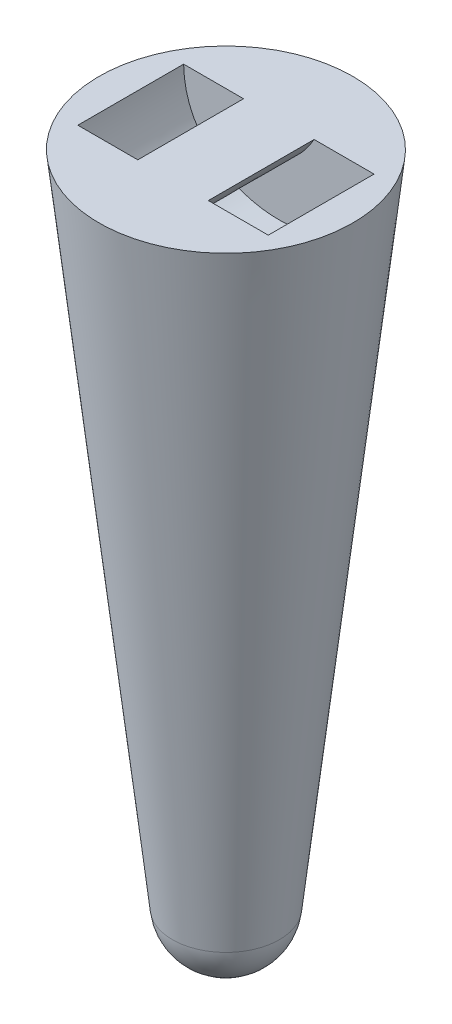
ISO-10303-21;
HEADER;
FILE_DESCRIPTION(('STEP AP214'),'2;1');
FILE_NAME('part.step','',(''),(''),'','','');
FILE_SCHEMA(('AUTOMOTIVE_DESIGN { 1 0 10303 214 1 1 1 1 }'));
ENDSEC;
DATA;
#1=APPLICATION_CONTEXT('core data for automotive mechanical design processes');
#2=APPLICATION_PROTOCOL_DEFINITION('international standard','automotive_design',2000,#1);
#3=PRODUCT_CONTEXT('',#1,'mechanical');
#4=PRODUCT('Part','Part','',(#3));
#5=PRODUCT_RELATED_PRODUCT_CATEGORY('part','',(#4));
#6=PRODUCT_DEFINITION_FORMATION('','',#4);
#7=PRODUCT_DEFINITION_CONTEXT('part definition',#1,'design');
#8=PRODUCT_DEFINITION('design','',#6,#7);
#9=PRODUCT_DEFINITION_SHAPE('','',#8);
#10=(LENGTH_UNIT() NAMED_UNIT(*) SI_UNIT(.MILLI.,.METRE.));
#11=(NAMED_UNIT(*) PLANE_ANGLE_UNIT() SI_UNIT($,.RADIAN.));
#12=(NAMED_UNIT(*) SI_UNIT($,.STERADIAN.) SOLID_ANGLE_UNIT());
#13=UNCERTAINTY_MEASURE_WITH_UNIT(LENGTH_MEASURE(1.E-05),#10,'distance_accuracy_value','');
#14=(GEOMETRIC_REPRESENTATION_CONTEXT(3) GLOBAL_UNCERTAINTY_ASSIGNED_CONTEXT((#13)) GLOBAL_UNIT_ASSIGNED_CONTEXT((#10,
#11,#12)) REPRESENTATION_CONTEXT('',''));
#15=CARTESIAN_POINT('',(0.,0.,0.));
#16=DIRECTION('',(0.,0.,1.));
#17=DIRECTION('',(1.,0.,0.));
#18=AXIS2_PLACEMENT_3D('',#15,#16,#17);
#19=CARTESIAN_POINT('',(-4.4433123350289E-06,113.062141242942,15.));
#20=DIRECTION('',(0.,0.,-1.));
#21=DIRECTION('',(-1.,0.,0.));
#22=AXIS2_PLACEMENT_3D('',#19,#20,#21);
#23=PLANE('',#22);
#24=DIRECTION('',(-1.,0.,0.));
#25=VECTOR('',#24,1.);
#26=CARTESIAN_POINT('',(-27.0000044433123,137.780827744254,15.));
#27=LINE('',#26,#25);
#28=CARTESIAN_POINT('',(-10.0000044433123,137.780827744254,15.));
#29=VERTEX_POINT('',#28);
#30=CARTESIAN_POINT('',(-27.0000044433123,137.780827744254,15.));
#31=VERTEX_POINT('',#30);
#32=EDGE_CURVE('E90',#29,#31,#27,.T.);
#33=ORIENTED_EDGE('',*,*,#32,.F.);
#34=CARTESIAN_POINT('',(-10.0000044433123,137.780827744254,15.));
#35=CARTESIAN_POINT('',(-4.44331233817309E-06,120.777323388645,15.));
#36=CARTESIAN_POINT('',(9.99999555668766,137.780827744254,15.));
#37=B_SPLINE_CURVE_WITH_KNOTS('',2,(#34,#35,#36),.UNSPECIFIED.,.F.,.F.,(3,3),(0.,1.),.UNSPECIFIED.);
#38=CARTESIAN_POINT('',(9.99999555668766,137.780827744254,15.));
#39=VERTEX_POINT('',#38);
#40=EDGE_CURVE('E80',#39,#29,#37,.F.);
#41=ORIENTED_EDGE('',*,*,#40,.F.);
#42=CARTESIAN_POINT('',(26.9999955566877,137.780827744254,15.));
#43=VERTEX_POINT('',#42);
#44=EDGE_CURVE('E88',#43,#39,#27,.T.);
#45=ORIENTED_EDGE('',*,*,#44,.F.);
#46=CARTESIAN_POINT('',(-27.0000044433123,137.780827744254,15.));
#47=CARTESIAN_POINT('',(-26.582231524912,104.822579075838,15.));
#48=CARTESIAN_POINT('',(26.5822226382873,104.822579075838,15.));
#49=CARTESIAN_POINT('',(26.9999955566877,137.780827744254,15.));
#50=B_SPLINE_CURVE_WITH_KNOTS('',3,(#46,#47,#48,#49),.UNSPECIFIED.,.F.,.F.,(4,4),(0.,1.),.UNSPECIFIED.);
#51=EDGE_CURVE('E100',#31,#43,#50,.T.);
#52=ORIENTED_EDGE('',*,*,#51,.F.);
#53=EDGE_LOOP('',(#33,#41,#45,#52));
#54=FACE_BOUND('',#53,.T.);
#55=ADVANCED_FACE('F36',(#54),#23,.T.);
#56=CARTESIAN_POINT('',(-4.4433123350289E-06,113.062141242942,-15.));
#57=DIRECTION('',(0.,0.,-1.));
#58=DIRECTION('',(-1.,0.,0.));
#59=AXIS2_PLACEMENT_3D('',#56,#57,#58);
#60=PLANE('',#59);
#61=CARTESIAN_POINT('',(-10.0000044433123,137.780827744254,-15.));
#62=CARTESIAN_POINT('',(-4.44331233817309E-06,120.777323388645,-15.));
#63=CARTESIAN_POINT('',(9.99999555668766,137.780827744254,-15.));
#64=B_SPLINE_CURVE_WITH_KNOTS('',2,(#61,#62,#63),.UNSPECIFIED.,.F.,.F.,(3,3),(0.,1.),.UNSPECIFIED.);
#65=CARTESIAN_POINT('',(-10.0000044433123,137.780827744254,-15.));
#66=VERTEX_POINT('',#65);
#67=CARTESIAN_POINT('',(9.99999555668766,137.780827744254,-15.));
#68=VERTEX_POINT('',#67);
#69=EDGE_CURVE('E82',#66,#68,#64,.T.);
#70=ORIENTED_EDGE('',*,*,#69,.F.);
#71=DIRECTION('',(-1.,0.,0.));
#72=VECTOR('',#71,1.);
#73=CARTESIAN_POINT('',(-27.0000044433123,137.780827744254,-15.));
#74=LINE('',#73,#72);
#75=CARTESIAN_POINT('',(-27.0000044433123,137.780827744254,-15.));
#76=VERTEX_POINT('',#75);
#77=EDGE_CURVE('E138',#66,#76,#74,.T.);
#78=ORIENTED_EDGE('',*,*,#77,.T.);
#79=CARTESIAN_POINT('',(-27.0000044433123,137.780827744254,-15.));
#80=CARTESIAN_POINT('',(-26.582231524912,104.822579075838,-15.));
#81=CARTESIAN_POINT('',(26.5822226382873,104.822579075838,-15.));
#82=CARTESIAN_POINT('',(26.9999955566877,137.780827744254,-15.));
#83=B_SPLINE_CURVE_WITH_KNOTS('',3,(#79,#80,#81,#82),.UNSPECIFIED.,.F.,.F.,(4,4),(0.,1.),.UNSPECIFIED.);
#84=CARTESIAN_POINT('',(26.9999955566877,137.780827744254,-15.));
#85=VERTEX_POINT('',#84);
#86=EDGE_CURVE('E137',#76,#85,#83,.T.);
#87=ORIENTED_EDGE('',*,*,#86,.T.);
#88=EDGE_CURVE('E59',#85,#68,#74,.T.);
#89=ORIENTED_EDGE('',*,*,#88,.T.);
#90=EDGE_LOOP('',(#70,#78,#87,#89));
#91=FACE_BOUND('',#90,.T.);
#92=ADVANCED_FACE('F113',(#91),#60,.F.);
#93=CARTESIAN_POINT('',(-4.4433123350289E-06,137.780827744254,0.));
#94=DIRECTION('',(0.,-1.,0.));
#95=DIRECTION('',(0.,0.,-1.));
#96=AXIS2_PLACEMENT_3D('',#93,#94,#95);
#97=PLANE('',#96);
#98=DIRECTION('',(0.,0.,-1.));
#99=VECTOR('',#98,1.);
#100=CARTESIAN_POINT('',(-10.0000044433123,137.780827744254,36.004));
#101=LINE('',#100,#99);
#102=EDGE_CURVE('E51',#29,#66,#101,.T.);
#103=ORIENTED_EDGE('',*,*,#102,.F.);
#104=ORIENTED_EDGE('',*,*,#32,.T.);
#105=DIRECTION('',(0.,0.,-1.));
#106=VECTOR('',#105,1.);
#107=CARTESIAN_POINT('',(-27.0000044433123,137.780827744254,15.));
#108=LINE('',#107,#106);
#109=EDGE_CURVE('E96',#31,#76,#108,.T.);
#110=ORIENTED_EDGE('',*,*,#109,.T.);
#111=ORIENTED_EDGE('',*,*,#77,.F.);
#112=EDGE_LOOP('',(#103,#104,#110,#111));
#113=FACE_BOUND('',#112,.T.);
#114=CARTESIAN_POINT('',(-4.4433123350289E-06,137.780827744254,0.));
#115=DIRECTION('',(0.,-1.,0.));
#116=DIRECTION('',(0.,0.,-1.));
#117=AXIS2_PLACEMENT_3D('',#114,#115,#116);
#118=CIRCLE('',#117,36.);
#119=CARTESIAN_POINT('',(-4.4433123350289E-06,137.780827744254,-36.));
#120=VERTEX_POINT('',#119);
#121=EDGE_CURVE('E44',#120,#120,#118,.T.);
#122=ORIENTED_EDGE('',*,*,#121,.F.);
#123=EDGE_LOOP('',(#122));
#124=FACE_BOUND('',#123,.T.);
#125=ORIENTED_EDGE('',*,*,#44,.T.);
#126=DIRECTION('',(0.,0.,-1.));
#127=VECTOR('',#126,1.);
#128=CARTESIAN_POINT('',(9.99999555668766,137.780827744254,36.004));
#129=LINE('',#128,#127);
#130=EDGE_CURVE('E77',#39,#68,#129,.T.);
#131=ORIENTED_EDGE('',*,*,#130,.T.);
#132=ORIENTED_EDGE('',*,*,#88,.F.);
#133=DIRECTION('',(0.,0.,-1.));
#134=VECTOR('',#133,1.);
#135=CARTESIAN_POINT('',(26.9999955566877,137.780827744254,15.));
#136=LINE('',#135,#134);
#137=EDGE_CURVE('E95',#43,#85,#136,.T.);
#138=ORIENTED_EDGE('',*,*,#137,.F.);
#139=EDGE_LOOP('',(#125,#131,#132,#138));
#140=FACE_BOUND('',#139,.T.);
#141=ADVANCED_FACE('F93',(#113,#124,#140),#97,.F.);
#142=CARTESIAN_POINT('',(-4.4433123350289E-06,-46.9387911169357,0.));
#143=DIRECTION('',(0.,-1.,0.));
#144=DIRECTION('',(-1.,0.,0.));
#145=AXIS2_PLACEMENT_3D('',#142,#143,#144);
#146=SPHERICAL_SURFACE('',#145,15.2803811388105);
#147=CARTESIAN_POINT('',(-4.4433123350289E-06,-48.6343690314798,0.));
#148=DIRECTION('',(0.,-1.,0.));
#149=DIRECTION('',(0.,0.,-1.));
#150=AXIS2_PLACEMENT_3D('',#147,#148,#149);
#151=CIRCLE('',#150,15.1860153853151);
#152=CARTESIAN_POINT('',(-4.4433123350289E-06,-48.6343690314798,-15.1860153853151));
#153=VERTEX_POINT('',#152);
#154=EDGE_CURVE('E11',#153,#153,#151,.T.);
#155=ORIENTED_EDGE('',*,*,#154,.T.);
#156=EDGE_LOOP('',(#155));
#157=FACE_BOUND('',#156,.T.);
#158=ADVANCED_FACE('F38',(#157),#146,.T.);
#159=CARTESIAN_POINT('',(-4.4433123350289E-06,137.780827744254,0.));
#160=DIRECTION('',(0.,1.,0.));
#161=DIRECTION('',(0.,0.,1.));
#162=AXIS2_PLACEMENT_3D('',#159,#160,#161);
#163=CONICAL_SURFACE('',#162,36.,0.111193363332835);
#164=ORIENTED_EDGE('',*,*,#154,.F.);
#165=EDGE_LOOP('',(#164));
#166=FACE_BOUND('',#165,.T.);
#167=ORIENTED_EDGE('',*,*,#121,.T.);
#168=EDGE_LOOP('',(#167));
#169=FACE_BOUND('',#168,.T.);
#170=ADVANCED_FACE('F110',(#166,#169),#163,.T.);
#171=DIRECTION('',(0.,0.,-1.));
#172=VECTOR('',#171,1.);
#173=SURFACE_OF_LINEAR_EXTRUSION('',#50,#172);
#174=ORIENTED_EDGE('',*,*,#109,.F.);
#175=ORIENTED_EDGE('',*,*,#51,.T.);
#176=ORIENTED_EDGE('',*,*,#137,.T.);
#177=ORIENTED_EDGE('',*,*,#86,.F.);
#178=EDGE_LOOP('',(#174,#175,#176,#177));
#179=FACE_BOUND('',#178,.T.);
#180=ADVANCED_FACE('F127',(#179),#173,.T.);
#181=CARTESIAN_POINT('',(-10.0000044433123,137.780827744254,36.004));
#182=CARTESIAN_POINT('',(-4.44331233817309E-06,120.777323388645,36.004));
#183=CARTESIAN_POINT('',(9.99999555668766,137.780827744254,36.004));
#184=B_SPLINE_CURVE_WITH_KNOTS('',2,(#181,#182,#183),.UNSPECIFIED.,.F.,.F.,(3,3),(0.,1.),.UNSPECIFIED.);
#185=DIRECTION('',(0.,0.,-1.));
#186=VECTOR('',#185,1.);
#187=SURFACE_OF_LINEAR_EXTRUSION('',#184,#186);
#188=ORIENTED_EDGE('',*,*,#130,.F.);
#189=ORIENTED_EDGE('',*,*,#40,.T.);
#190=ORIENTED_EDGE('',*,*,#102,.T.);
#191=ORIENTED_EDGE('',*,*,#69,.T.);
#192=EDGE_LOOP('',(#188,#189,#190,#191));
#193=FACE_BOUND('',#192,.T.);
#194=ADVANCED_FACE('F79',(#193),#187,.F.);
#195=CLOSED_SHELL('',(#55,#92,#141,#158,#170,#180,#194));
#196=MANIFOLD_SOLID_BREP('B2',#195);
#197=ADVANCED_BREP_SHAPE_REPRESENTATION('',(#18,#196),#14);
#198=SHAPE_DEFINITION_REPRESENTATION(#9,#197);
ENDSEC;
END-ISO-10303-21;
